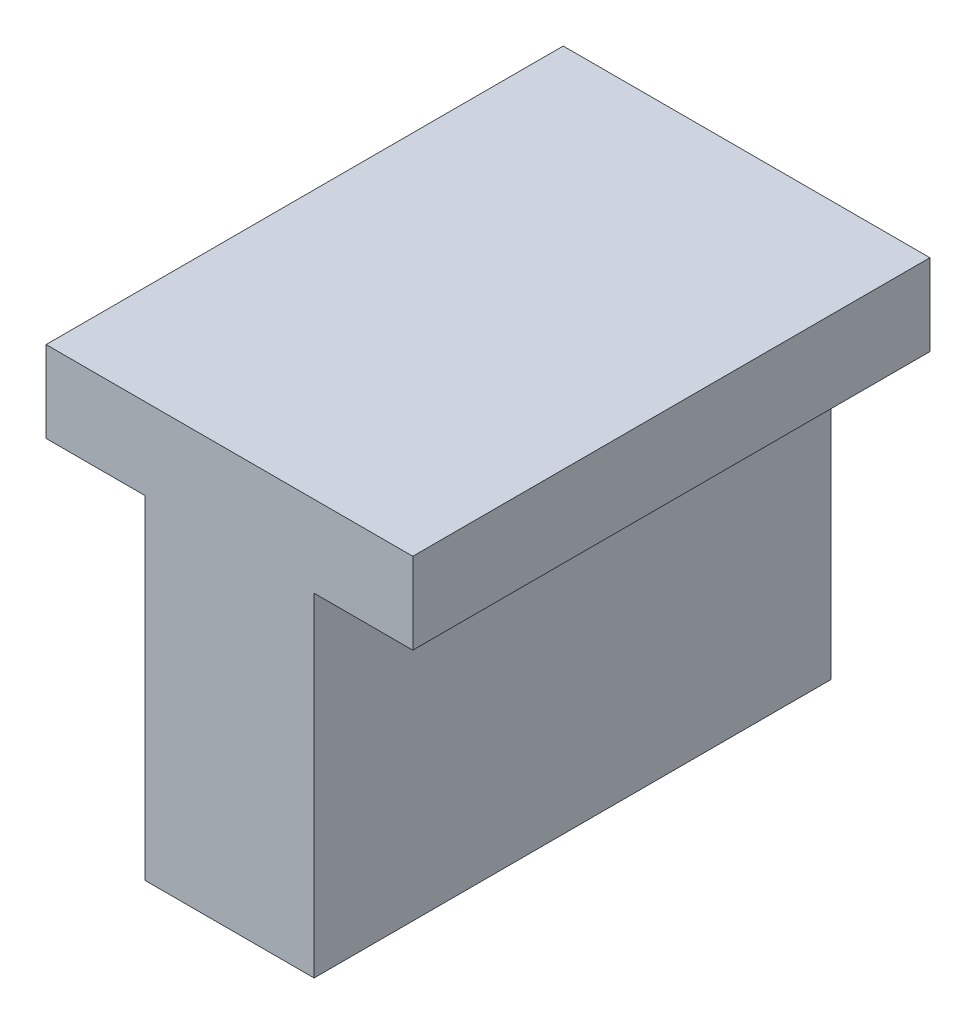
ISO-10303-21;
HEADER;
FILE_DESCRIPTION(('STEP AP214'),'2;1');
FILE_NAME('part.step','',(''),(''),'','','');
FILE_SCHEMA(('AUTOMOTIVE_DESIGN { 1 0 10303 214 1 1 1 1 }'));
ENDSEC;
DATA;
#1=APPLICATION_CONTEXT('core data for automotive mechanical design processes');
#2=APPLICATION_PROTOCOL_DEFINITION('international standard','automotive_design',2000,#1);
#3=PRODUCT_CONTEXT('',#1,'mechanical');
#4=PRODUCT('Part','Part','',(#3));
#5=PRODUCT_RELATED_PRODUCT_CATEGORY('part','',(#4));
#6=PRODUCT_DEFINITION_FORMATION('','',#4);
#7=PRODUCT_DEFINITION_CONTEXT('part definition',#1,'design');
#8=PRODUCT_DEFINITION('design','',#6,#7);
#9=PRODUCT_DEFINITION_SHAPE('','',#8);
#10=(LENGTH_UNIT() NAMED_UNIT(*) SI_UNIT(.MILLI.,.METRE.));
#11=(NAMED_UNIT(*) PLANE_ANGLE_UNIT() SI_UNIT($,.RADIAN.));
#12=(NAMED_UNIT(*) SI_UNIT($,.STERADIAN.) SOLID_ANGLE_UNIT());
#13=UNCERTAINTY_MEASURE_WITH_UNIT(LENGTH_MEASURE(1.E-05),#10,'distance_accuracy_value','');
#14=(GEOMETRIC_REPRESENTATION_CONTEXT(3) GLOBAL_UNCERTAINTY_ASSIGNED_CONTEXT((#13)) GLOBAL_UNIT_ASSIGNED_CONTEXT((#10,
#11,#12)) REPRESENTATION_CONTEXT('',''));
#15=CARTESIAN_POINT('',(0.,0.,0.));
#16=DIRECTION('',(0.,0.,1.));
#17=DIRECTION('',(1.,0.,0.));
#18=AXIS2_PLACEMENT_3D('',#15,#16,#17);
#19=CARTESIAN_POINT('',(-40.1732655730958,24.5427117323691,11.));
#20=DIRECTION('',(1.,0.,0.));
#21=DIRECTION('',(0.,0.,-1.));
#22=AXIS2_PLACEMENT_3D('',#19,#20,#21);
#23=PLANE('',#22);
#24=DIRECTION('',(0.,-1.,0.));
#25=VECTOR('',#24,1.);
#26=CARTESIAN_POINT('',(-40.1732655730958,24.5427117323691,0.));
#27=LINE('',#26,#25);
#28=CARTESIAN_POINT('',(-40.1732655730958,24.5427117323691,0.));
#29=VERTEX_POINT('',#28);
#30=CARTESIAN_POINT('',(-40.1732655730958,22.8127117323691,0.));
#31=VERTEX_POINT('',#30);
#32=EDGE_CURVE('E140',#29,#31,#27,.T.);
#33=ORIENTED_EDGE('',*,*,#32,.T.);
#34=DIRECTION('',(0.,0.,-1.));
#35=VECTOR('',#34,1.);
#36=CARTESIAN_POINT('',(-40.1732655730958,22.8127117323691,11.));
#37=LINE('',#36,#35);
#38=CARTESIAN_POINT('',(-40.1732655730958,22.8127117323691,11.));
#39=VERTEX_POINT('',#38);
#40=EDGE_CURVE('E11',#39,#31,#37,.T.);
#41=ORIENTED_EDGE('',*,*,#40,.F.);
#42=DIRECTION('',(0.,-1.,0.));
#43=VECTOR('',#42,1.);
#44=CARTESIAN_POINT('',(-40.1732655730958,24.5427117323691,11.));
#45=LINE('',#44,#43);
#46=CARTESIAN_POINT('',(-40.1732655730958,24.5427117323691,11.));
#47=VERTEX_POINT('',#46);
#48=EDGE_CURVE('E162',#47,#39,#45,.T.);
#49=ORIENTED_EDGE('',*,*,#48,.F.);
#50=DIRECTION('',(0.,0.,-1.));
#51=VECTOR('',#50,1.);
#52=CARTESIAN_POINT('',(-40.1732655730958,24.5427117323691,11.));
#53=LINE('',#52,#51);
#54=EDGE_CURVE('E136',#47,#29,#53,.T.);
#55=ORIENTED_EDGE('',*,*,#54,.T.);
#56=EDGE_LOOP('',(#33,#41,#49,#55));
#57=FACE_BOUND('',#56,.T.);
#58=ADVANCED_FACE('F39',(#57),#23,.F.);
#59=CARTESIAN_POINT('',(-40.1732655730958,22.8127117323691,11.));
#60=DIRECTION('',(0.,1.,0.));
#61=DIRECTION('',(0.,0.,1.));
#62=AXIS2_PLACEMENT_3D('',#59,#60,#61);
#63=PLANE('',#62);
#64=DIRECTION('',(1.,0.,0.));
#65=VECTOR('',#64,1.);
#66=CARTESIAN_POINT('',(-40.1732655730958,22.8127117323691,0.));
#67=LINE('',#66,#65);
#68=CARTESIAN_POINT('',(-38.0732655730958,22.8127117323691,0.));
#69=VERTEX_POINT('',#68);
#70=EDGE_CURVE('E144',#31,#69,#67,.T.);
#71=ORIENTED_EDGE('',*,*,#70,.T.);
#72=DIRECTION('',(0.,0.,-1.));
#73=VECTOR('',#72,1.);
#74=CARTESIAN_POINT('',(-38.0732655730958,22.8127117323691,11.));
#75=LINE('',#74,#73);
#76=CARTESIAN_POINT('',(-38.0732655730958,22.8127117323691,11.));
#77=VERTEX_POINT('',#76);
#78=EDGE_CURVE('E48',#77,#69,#75,.T.);
#79=ORIENTED_EDGE('',*,*,#78,.F.);
#80=DIRECTION('',(1.,0.,0.));
#81=VECTOR('',#80,1.);
#82=CARTESIAN_POINT('',(-40.1732655730958,22.8127117323691,11.));
#83=LINE('',#82,#81);
#84=EDGE_CURVE('E99',#39,#77,#83,.T.);
#85=ORIENTED_EDGE('',*,*,#84,.F.);
#86=ORIENTED_EDGE('',*,*,#40,.T.);
#87=EDGE_LOOP('',(#71,#79,#85,#86));
#88=FACE_BOUND('',#87,.T.);
#89=ADVANCED_FACE('F208',(#88),#63,.F.);
#90=CARTESIAN_POINT('',(-38.0732655730958,22.8127117323691,11.));
#91=DIRECTION('',(1.,0.,0.));
#92=DIRECTION('',(0.,0.,-1.));
#93=AXIS2_PLACEMENT_3D('',#90,#91,#92);
#94=PLANE('',#93);
#95=DIRECTION('',(0.,-1.,0.));
#96=VECTOR('',#95,1.);
#97=CARTESIAN_POINT('',(-38.0732655730958,22.8127117323691,0.));
#98=LINE('',#97,#96);
#99=CARTESIAN_POINT('',(-38.0732655730958,15.723691168153,0.));
#100=VERTEX_POINT('',#99);
#101=EDGE_CURVE('E147',#69,#100,#98,.T.);
#102=ORIENTED_EDGE('',*,*,#101,.T.);
#103=DIRECTION('',(0.,0.,-1.));
#104=VECTOR('',#103,1.);
#105=CARTESIAN_POINT('',(-38.0732655730958,15.723691168153,11.));
#106=LINE('',#105,#104);
#107=CARTESIAN_POINT('',(-38.0732655730958,15.723691168153,11.));
#108=VERTEX_POINT('',#107);
#109=EDGE_CURVE('E173',#108,#100,#106,.T.);
#110=ORIENTED_EDGE('',*,*,#109,.F.);
#111=DIRECTION('',(0.,-1.,0.));
#112=VECTOR('',#111,1.);
#113=CARTESIAN_POINT('',(-38.0732655730958,22.8127117323691,11.));
#114=LINE('',#113,#112);
#115=EDGE_CURVE('E183',#77,#108,#114,.T.);
#116=ORIENTED_EDGE('',*,*,#115,.F.);
#117=ORIENTED_EDGE('',*,*,#78,.T.);
#118=EDGE_LOOP('',(#102,#110,#116,#117));
#119=FACE_BOUND('',#118,.T.);
#120=ADVANCED_FACE('F181',(#119),#94,.F.);
#121=CARTESIAN_POINT('',(-38.0732655730958,15.723691168153,11.));
#122=DIRECTION('',(0.,1.,0.));
#123=DIRECTION('',(0.,0.,1.));
#124=AXIS2_PLACEMENT_3D('',#121,#122,#123);
#125=PLANE('',#124);
#126=DIRECTION('',(1.,0.,0.));
#127=VECTOR('',#126,1.);
#128=CARTESIAN_POINT('',(-38.0732655730958,15.723691168153,0.));
#129=LINE('',#128,#127);
#130=CARTESIAN_POINT('',(-34.4732655730958,15.723691168153,0.));
#131=VERTEX_POINT('',#130);
#132=EDGE_CURVE('E150',#100,#131,#129,.T.);
#133=ORIENTED_EDGE('',*,*,#132,.T.);
#134=DIRECTION('',(0.,0.,-1.));
#135=VECTOR('',#134,1.);
#136=CARTESIAN_POINT('',(-34.4732655730958,15.723691168153,11.));
#137=LINE('',#136,#135);
#138=CARTESIAN_POINT('',(-34.4732655730958,15.723691168153,11.));
#139=VERTEX_POINT('',#138);
#140=EDGE_CURVE('E169',#139,#131,#137,.T.);
#141=ORIENTED_EDGE('',*,*,#140,.F.);
#142=DIRECTION('',(1.,0.,0.));
#143=VECTOR('',#142,1.);
#144=CARTESIAN_POINT('',(-38.0732655730958,15.723691168153,11.));
#145=LINE('',#144,#143);
#146=EDGE_CURVE('E196',#108,#139,#145,.T.);
#147=ORIENTED_EDGE('',*,*,#146,.F.);
#148=ORIENTED_EDGE('',*,*,#109,.T.);
#149=EDGE_LOOP('',(#133,#141,#147,#148));
#150=FACE_BOUND('',#149,.T.);
#151=ADVANCED_FACE('F191',(#150),#125,.F.);
#152=CARTESIAN_POINT('',(-34.4732655730958,22.8127117323691,11.));
#153=DIRECTION('',(-1.,0.,0.));
#154=DIRECTION('',(0.,0.,1.));
#155=AXIS2_PLACEMENT_3D('',#152,#153,#154);
#156=PLANE('',#155);
#157=DIRECTION('',(0.,1.,0.));
#158=VECTOR('',#157,1.);
#159=CARTESIAN_POINT('',(-34.4732655730958,22.8127117323691,0.));
#160=LINE('',#159,#158);
#161=CARTESIAN_POINT('',(-34.4732655730958,22.8127117323691,0.));
#162=VERTEX_POINT('',#161);
#163=EDGE_CURVE('E153',#131,#162,#160,.T.);
#164=ORIENTED_EDGE('',*,*,#163,.T.);
#165=DIRECTION('',(0.,0.,-1.));
#166=VECTOR('',#165,1.);
#167=CARTESIAN_POINT('',(-34.4732655730958,22.8127117323691,11.));
#168=LINE('',#167,#166);
#169=CARTESIAN_POINT('',(-34.4732655730958,22.8127117323691,11.));
#170=VERTEX_POINT('',#169);
#171=EDGE_CURVE('E129',#170,#162,#168,.T.);
#172=ORIENTED_EDGE('',*,*,#171,.F.);
#173=DIRECTION('',(0.,1.,0.));
#174=VECTOR('',#173,1.);
#175=CARTESIAN_POINT('',(-34.4732655730958,22.8127117323691,11.));
#176=LINE('',#175,#174);
#177=EDGE_CURVE('E118',#139,#170,#176,.T.);
#178=ORIENTED_EDGE('',*,*,#177,.F.);
#179=ORIENTED_EDGE('',*,*,#140,.T.);
#180=EDGE_LOOP('',(#164,#172,#178,#179));
#181=FACE_BOUND('',#180,.T.);
#182=ADVANCED_FACE('F194',(#181),#156,.F.);
#183=CARTESIAN_POINT('',(-32.3732655730958,22.8127117323691,11.));
#184=DIRECTION('',(0.,1.,0.));
#185=DIRECTION('',(0.,0.,1.));
#186=AXIS2_PLACEMENT_3D('',#183,#184,#185);
#187=PLANE('',#186);
#188=DIRECTION('',(1.,0.,0.));
#189=VECTOR('',#188,1.);
#190=CARTESIAN_POINT('',(-32.3732655730958,22.8127117323691,0.));
#191=LINE('',#190,#189);
#192=CARTESIAN_POINT('',(-32.3732655730958,22.8127117323691,0.));
#193=VERTEX_POINT('',#192);
#194=EDGE_CURVE('E127',#162,#193,#191,.T.);
#195=ORIENTED_EDGE('',*,*,#194,.T.);
#196=DIRECTION('',(0.,0.,-1.));
#197=VECTOR('',#196,1.);
#198=CARTESIAN_POINT('',(-32.3732655730958,22.8127117323691,11.));
#199=LINE('',#198,#197);
#200=CARTESIAN_POINT('',(-32.3732655730958,22.8127117323691,11.));
#201=VERTEX_POINT('',#200);
#202=EDGE_CURVE('E124',#201,#193,#199,.T.);
#203=ORIENTED_EDGE('',*,*,#202,.F.);
#204=DIRECTION('',(1.,0.,0.));
#205=VECTOR('',#204,1.);
#206=CARTESIAN_POINT('',(-32.3732655730958,22.8127117323691,11.));
#207=LINE('',#206,#205);
#208=EDGE_CURVE('E112',#170,#201,#207,.T.);
#209=ORIENTED_EDGE('',*,*,#208,.F.);
#210=ORIENTED_EDGE('',*,*,#171,.T.);
#211=EDGE_LOOP('',(#195,#203,#209,#210));
#212=FACE_BOUND('',#211,.T.);
#213=ADVANCED_FACE('F125',(#212),#187,.F.);
#214=CARTESIAN_POINT('',(-32.3732655730958,24.5427117323691,11.));
#215=DIRECTION('',(-1.,0.,0.));
#216=DIRECTION('',(0.,0.,1.));
#217=AXIS2_PLACEMENT_3D('',#214,#215,#216);
#218=PLANE('',#217);
#219=DIRECTION('',(0.,1.,0.));
#220=VECTOR('',#219,1.);
#221=CARTESIAN_POINT('',(-32.3732655730958,24.5427117323691,0.));
#222=LINE('',#221,#220);
#223=CARTESIAN_POINT('',(-32.3732655730958,24.5427117323691,0.));
#224=VERTEX_POINT('',#223);
#225=EDGE_CURVE('E85',#193,#224,#222,.T.);
#226=ORIENTED_EDGE('',*,*,#225,.T.);
#227=DIRECTION('',(0.,0.,-1.));
#228=VECTOR('',#227,1.);
#229=CARTESIAN_POINT('',(-32.3732655730958,24.5427117323691,11.));
#230=LINE('',#229,#228);
#231=CARTESIAN_POINT('',(-32.3732655730958,24.5427117323691,11.));
#232=VERTEX_POINT('',#231);
#233=EDGE_CURVE('E130',#232,#224,#230,.T.);
#234=ORIENTED_EDGE('',*,*,#233,.F.);
#235=DIRECTION('',(0.,1.,0.));
#236=VECTOR('',#235,1.);
#237=CARTESIAN_POINT('',(-32.3732655730958,24.5427117323691,11.));
#238=LINE('',#237,#236);
#239=EDGE_CURVE('E116',#201,#232,#238,.T.);
#240=ORIENTED_EDGE('',*,*,#239,.F.);
#241=ORIENTED_EDGE('',*,*,#202,.T.);
#242=EDGE_LOOP('',(#226,#234,#240,#241));
#243=FACE_BOUND('',#242,.T.);
#244=ADVANCED_FACE('F132',(#243),#218,.F.);
#245=CARTESIAN_POINT('',(-40.1732655730958,24.5427117323691,11.));
#246=DIRECTION('',(0.,-1.,0.));
#247=DIRECTION('',(0.,0.,-1.));
#248=AXIS2_PLACEMENT_3D('',#245,#246,#247);
#249=PLANE('',#248);
#250=DIRECTION('',(-1.,0.,0.));
#251=VECTOR('',#250,1.);
#252=CARTESIAN_POINT('',(-40.1732655730958,24.5427117323691,0.));
#253=LINE('',#252,#251);
#254=EDGE_CURVE('E91',#224,#29,#253,.T.);
#255=ORIENTED_EDGE('',*,*,#254,.T.);
#256=ORIENTED_EDGE('',*,*,#54,.F.);
#257=DIRECTION('',(-1.,0.,0.));
#258=VECTOR('',#257,1.);
#259=CARTESIAN_POINT('',(-40.1732655730958,24.5427117323691,11.));
#260=LINE('',#259,#258);
#261=EDGE_CURVE('E56',#232,#47,#260,.T.);
#262=ORIENTED_EDGE('',*,*,#261,.F.);
#263=ORIENTED_EDGE('',*,*,#233,.T.);
#264=EDGE_LOOP('',(#255,#256,#262,#263));
#265=FACE_BOUND('',#264,.T.);
#266=ADVANCED_FACE('F224',(#265),#249,.F.);
#267=CARTESIAN_POINT('',(0.,0.,11.));
#268=DIRECTION('',(0.,0.,1.));
#269=DIRECTION('',(1.,0.,0.));
#270=AXIS2_PLACEMENT_3D('',#267,#268,#269);
#271=PLANE('',#270);
#272=ORIENTED_EDGE('',*,*,#48,.T.);
#273=ORIENTED_EDGE('',*,*,#84,.T.);
#274=ORIENTED_EDGE('',*,*,#115,.T.);
#275=ORIENTED_EDGE('',*,*,#146,.T.);
#276=ORIENTED_EDGE('',*,*,#177,.T.);
#277=ORIENTED_EDGE('',*,*,#208,.T.);
#278=ORIENTED_EDGE('',*,*,#239,.T.);
#279=ORIENTED_EDGE('',*,*,#261,.T.);
#280=EDGE_LOOP('',(#272,#273,#274,#275,#276,#277,#278,#279));
#281=FACE_BOUND('',#280,.T.);
#282=ADVANCED_FACE('F114',(#281),#271,.T.);
#283=CARTESIAN_POINT('',(0.,0.,0.));
#284=DIRECTION('',(0.,0.,1.));
#285=DIRECTION('',(1.,0.,0.));
#286=AXIS2_PLACEMENT_3D('',#283,#284,#285);
#287=PLANE('',#286);
#288=ORIENTED_EDGE('',*,*,#32,.F.);
#289=ORIENTED_EDGE('',*,*,#254,.F.);
#290=ORIENTED_EDGE('',*,*,#225,.F.);
#291=ORIENTED_EDGE('',*,*,#194,.F.);
#292=ORIENTED_EDGE('',*,*,#163,.F.);
#293=ORIENTED_EDGE('',*,*,#132,.F.);
#294=ORIENTED_EDGE('',*,*,#101,.F.);
#295=ORIENTED_EDGE('',*,*,#70,.F.);
#296=EDGE_LOOP('',(#288,#289,#290,#291,#292,#293,#294,#295));
#297=FACE_BOUND('',#296,.T.);
#298=ADVANCED_FACE('F187',(#297),#287,.F.);
#299=CLOSED_SHELL('',(#58,#89,#120,#151,#182,#213,#244,#266,#282,#298));
#300=MANIFOLD_SOLID_BREP('B2',#299);
#301=ADVANCED_BREP_SHAPE_REPRESENTATION('',(#18,#300),#14);
#302=SHAPE_DEFINITION_REPRESENTATION(#9,#301);
ENDSEC;
END-ISO-10303-21;
